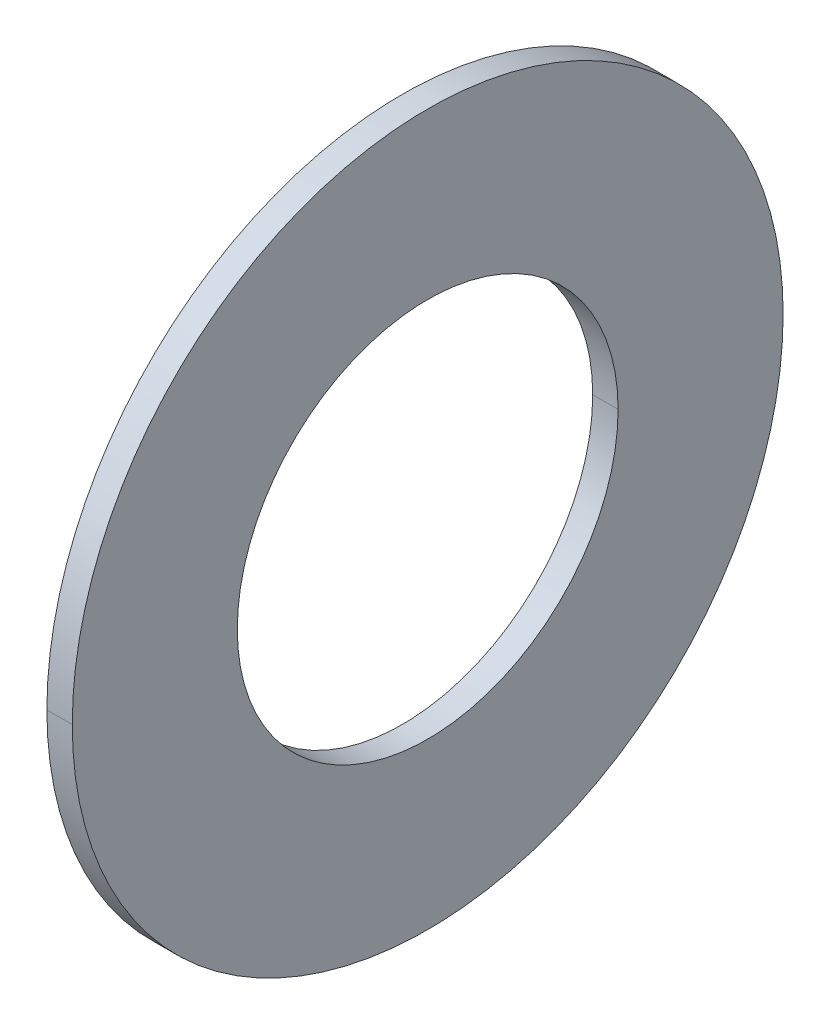
ISO-10303-21;
HEADER;
FILE_DESCRIPTION(('STEP AP214'),'2;1');
FILE_NAME('part.step','',(''),(''),'','','');
FILE_SCHEMA(('AUTOMOTIVE_DESIGN { 1 0 10303 214 1 1 1 1 }'));
ENDSEC;
DATA;
#1=APPLICATION_CONTEXT('core data for automotive mechanical design processes');
#2=APPLICATION_PROTOCOL_DEFINITION('international standard','automotive_design',2000,#1);
#3=PRODUCT_CONTEXT('',#1,'mechanical');
#4=PRODUCT('Part','Part','',(#3));
#5=PRODUCT_RELATED_PRODUCT_CATEGORY('part','',(#4));
#6=PRODUCT_DEFINITION_FORMATION('','',#4);
#7=PRODUCT_DEFINITION_CONTEXT('part definition',#1,'design');
#8=PRODUCT_DEFINITION('design','',#6,#7);
#9=PRODUCT_DEFINITION_SHAPE('','',#8);
#10=(LENGTH_UNIT() NAMED_UNIT(*) SI_UNIT(.MILLI.,.METRE.));
#11=(NAMED_UNIT(*) PLANE_ANGLE_UNIT() SI_UNIT($,.RADIAN.));
#12=(NAMED_UNIT(*) SI_UNIT($,.STERADIAN.) SOLID_ANGLE_UNIT());
#13=UNCERTAINTY_MEASURE_WITH_UNIT(LENGTH_MEASURE(1.E-05),#10,'distance_accuracy_value','');
#14=(GEOMETRIC_REPRESENTATION_CONTEXT(3) GLOBAL_UNCERTAINTY_ASSIGNED_CONTEXT((#13)) GLOBAL_UNIT_ASSIGNED_CONTEXT((#10,
#11,#12)) REPRESENTATION_CONTEXT('',''));
#15=CARTESIAN_POINT('',(0.,0.,0.));
#16=DIRECTION('',(0.,0.,1.));
#17=DIRECTION('',(1.,0.,0.));
#18=AXIS2_PLACEMENT_3D('',#15,#16,#17);
#19=CARTESIAN_POINT('',(-2.,14.,0.));
#20=DIRECTION('',(-1.,0.,0.));
#21=DIRECTION('',(0.,0.,1.));
#22=AXIS2_PLACEMENT_3D('',#19,#20,#21);
#23=PLANE('',#22);
#24=CARTESIAN_POINT('',(-2.,0.,0.));
#25=DIRECTION('',(1.,0.,0.));
#26=DIRECTION('',(0.,0.,-1.));
#27=AXIS2_PLACEMENT_3D('',#24,#25,#26);
#28=CIRCLE('',#27,7.5);
#29=CARTESIAN_POINT('',(-2.,0.,-7.5));
#30=VERTEX_POINT('',#29);
#31=CARTESIAN_POINT('',(-2.,0.,7.5));
#32=VERTEX_POINT('',#31);
#33=EDGE_CURVE('E11',#30,#32,#28,.T.);
#34=ORIENTED_EDGE('',*,*,#33,.T.);
#35=CARTESIAN_POINT('',(-2.,0.,0.));
#36=DIRECTION('',(1.,0.,0.));
#37=DIRECTION('',(0.,0.,-1.));
#38=AXIS2_PLACEMENT_3D('',#35,#36,#37);
#39=CIRCLE('',#38,7.5);
#40=EDGE_CURVE('E25',#32,#30,#39,.T.);
#41=ORIENTED_EDGE('',*,*,#40,.T.);
#42=EDGE_LOOP('',(#34,#41));
#43=FACE_BOUND('',#42,.T.);
#44=CARTESIAN_POINT('',(-2.,0.,0.));
#45=DIRECTION('',(1.,0.,0.));
#46=DIRECTION('',(0.,0.,-1.));
#47=AXIS2_PLACEMENT_3D('',#44,#45,#46);
#48=CIRCLE('',#47,14.);
#49=CARTESIAN_POINT('',(-2.,0.,14.));
#50=VERTEX_POINT('',#49);
#51=CARTESIAN_POINT('',(-2.,0.,-14.));
#52=VERTEX_POINT('',#51);
#53=EDGE_CURVE('E95',#50,#52,#48,.T.);
#54=ORIENTED_EDGE('',*,*,#53,.F.);
#55=CARTESIAN_POINT('',(-2.,0.,0.));
#56=DIRECTION('',(1.,0.,0.));
#57=DIRECTION('',(0.,0.,-1.));
#58=AXIS2_PLACEMENT_3D('',#55,#56,#57);
#59=CIRCLE('',#58,14.);
#60=EDGE_CURVE('E90',#52,#50,#59,.T.);
#61=ORIENTED_EDGE('',*,*,#60,.F.);
#62=EDGE_LOOP('',(#54,#61));
#63=FACE_BOUND('',#62,.T.);
#64=ADVANCED_FACE('F17',(#43,#63),#23,.T.);
#65=CARTESIAN_POINT('',(50.,0.,0.));
#66=DIRECTION('',(1.,0.,0.));
#67=DIRECTION('',(0.,-1.,0.));
#68=AXIS2_PLACEMENT_3D('',#65,#66,#67);
#69=CYLINDRICAL_SURFACE('',#68,14.);
#70=DIRECTION('',(1.,0.,0.));
#71=VECTOR('',#70,1.);
#72=CARTESIAN_POINT('',(-2.,0.,14.));
#73=LINE('',#72,#71);
#74=CARTESIAN_POINT('',(-1.,0.,14.));
#75=VERTEX_POINT('',#74);
#76=EDGE_CURVE('E86',#50,#75,#73,.T.);
#77=ORIENTED_EDGE('',*,*,#76,.T.);
#78=CARTESIAN_POINT('',(-1.,0.,0.));
#79=DIRECTION('',(1.,0.,0.));
#80=DIRECTION('',(0.,0.,-1.));
#81=AXIS2_PLACEMENT_3D('',#78,#79,#80);
#82=CIRCLE('',#81,14.);
#83=CARTESIAN_POINT('',(-1.,0.,-14.));
#84=VERTEX_POINT('',#83);
#85=EDGE_CURVE('E81',#84,#75,#82,.T.);
#86=ORIENTED_EDGE('',*,*,#85,.F.);
#87=DIRECTION('',(1.,0.,0.));
#88=VECTOR('',#87,1.);
#89=CARTESIAN_POINT('',(-2.,0.,-14.));
#90=LINE('',#89,#88);
#91=EDGE_CURVE('E70',#52,#84,#90,.T.);
#92=ORIENTED_EDGE('',*,*,#91,.F.);
#93=ORIENTED_EDGE('',*,*,#60,.T.);
#94=EDGE_LOOP('',(#77,#86,#92,#93));
#95=FACE_BOUND('',#94,.T.);
#96=ADVANCED_FACE('F111',(#95),#69,.T.);
#97=CARTESIAN_POINT('',(50.,0.,0.));
#98=DIRECTION('',(1.,0.,0.));
#99=DIRECTION('',(0.,1.,0.));
#100=AXIS2_PLACEMENT_3D('',#97,#98,#99);
#101=CYLINDRICAL_SURFACE('',#100,14.);
#102=ORIENTED_EDGE('',*,*,#76,.F.);
#103=ORIENTED_EDGE('',*,*,#53,.T.);
#104=ORIENTED_EDGE('',*,*,#91,.T.);
#105=CARTESIAN_POINT('',(-1.,0.,0.));
#106=DIRECTION('',(1.,0.,0.));
#107=DIRECTION('',(0.,0.,-1.));
#108=AXIS2_PLACEMENT_3D('',#105,#106,#107);
#109=CIRCLE('',#108,14.);
#110=EDGE_CURVE('E67',#75,#84,#109,.T.);
#111=ORIENTED_EDGE('',*,*,#110,.F.);
#112=EDGE_LOOP('',(#102,#103,#104,#111));
#113=FACE_BOUND('',#112,.T.);
#114=ADVANCED_FACE('F106',(#113),#101,.T.);
#115=CARTESIAN_POINT('',(-1.,7.5,0.));
#116=DIRECTION('',(1.,0.,0.));
#117=DIRECTION('',(0.,0.,-1.));
#118=AXIS2_PLACEMENT_3D('',#115,#116,#117);
#119=PLANE('',#118);
#120=ORIENTED_EDGE('',*,*,#85,.T.);
#121=ORIENTED_EDGE('',*,*,#110,.T.);
#122=EDGE_LOOP('',(#120,#121));
#123=FACE_BOUND('',#122,.T.);
#124=CARTESIAN_POINT('',(-1.,0.,0.));
#125=DIRECTION('',(1.,0.,0.));
#126=DIRECTION('',(0.,0.,-1.));
#127=AXIS2_PLACEMENT_3D('',#124,#125,#126);
#128=CIRCLE('',#127,7.5);
#129=CARTESIAN_POINT('',(-1.,0.,7.5));
#130=VERTEX_POINT('',#129);
#131=CARTESIAN_POINT('',(-1.,0.,-7.5));
#132=VERTEX_POINT('',#131);
#133=EDGE_CURVE('E55',#130,#132,#128,.T.);
#134=ORIENTED_EDGE('',*,*,#133,.F.);
#135=CARTESIAN_POINT('',(-1.,0.,0.));
#136=DIRECTION('',(1.,0.,0.));
#137=DIRECTION('',(0.,0.,-1.));
#138=AXIS2_PLACEMENT_3D('',#135,#136,#137);
#139=CIRCLE('',#138,7.5);
#140=EDGE_CURVE('E51',#132,#130,#139,.T.);
#141=ORIENTED_EDGE('',*,*,#140,.F.);
#142=EDGE_LOOP('',(#134,#141));
#143=FACE_BOUND('',#142,.T.);
#144=ADVANCED_FACE('F53',(#123,#143),#119,.T.);
#145=CARTESIAN_POINT('',(50.,0.,0.));
#146=DIRECTION('',(1.,0.,0.));
#147=DIRECTION('',(0.,-1.,0.));
#148=AXIS2_PLACEMENT_3D('',#145,#146,#147);
#149=CYLINDRICAL_SURFACE('',#148,7.5);
#150=DIRECTION('',(1.,0.,0.));
#151=VECTOR('',#150,1.);
#152=CARTESIAN_POINT('',(-2.,0.,7.5));
#153=LINE('',#152,#151);
#154=EDGE_CURVE('E59',#32,#130,#153,.T.);
#155=ORIENTED_EDGE('',*,*,#154,.F.);
#156=ORIENTED_EDGE('',*,*,#33,.F.);
#157=DIRECTION('',(1.,0.,0.));
#158=VECTOR('',#157,1.);
#159=CARTESIAN_POINT('',(-2.,0.,-7.5));
#160=LINE('',#159,#158);
#161=EDGE_CURVE('E62',#30,#132,#160,.T.);
#162=ORIENTED_EDGE('',*,*,#161,.T.);
#163=ORIENTED_EDGE('',*,*,#140,.T.);
#164=EDGE_LOOP('',(#155,#156,#162,#163));
#165=FACE_BOUND('',#164,.T.);
#166=ADVANCED_FACE('F63',(#165),#149,.F.);
#167=CARTESIAN_POINT('',(50.,0.,0.));
#168=DIRECTION('',(1.,0.,0.));
#169=DIRECTION('',(0.,1.,0.));
#170=AXIS2_PLACEMENT_3D('',#167,#168,#169);
#171=CYLINDRICAL_SURFACE('',#170,7.5);
#172=ORIENTED_EDGE('',*,*,#154,.T.);
#173=ORIENTED_EDGE('',*,*,#133,.T.);
#174=ORIENTED_EDGE('',*,*,#161,.F.);
#175=ORIENTED_EDGE('',*,*,#40,.F.);
#176=EDGE_LOOP('',(#172,#173,#174,#175));
#177=FACE_BOUND('',#176,.T.);
#178=ADVANCED_FACE('F66',(#177),#171,.F.);
#179=CLOSED_SHELL('',(#64,#96,#114,#144,#166,#178));
#180=MANIFOLD_SOLID_BREP('B1',#179);
#181=ADVANCED_BREP_SHAPE_REPRESENTATION('',(#18,#180),#14);
#182=SHAPE_DEFINITION_REPRESENTATION(#9,#181);
ENDSEC;
END-ISO-10303-21;
